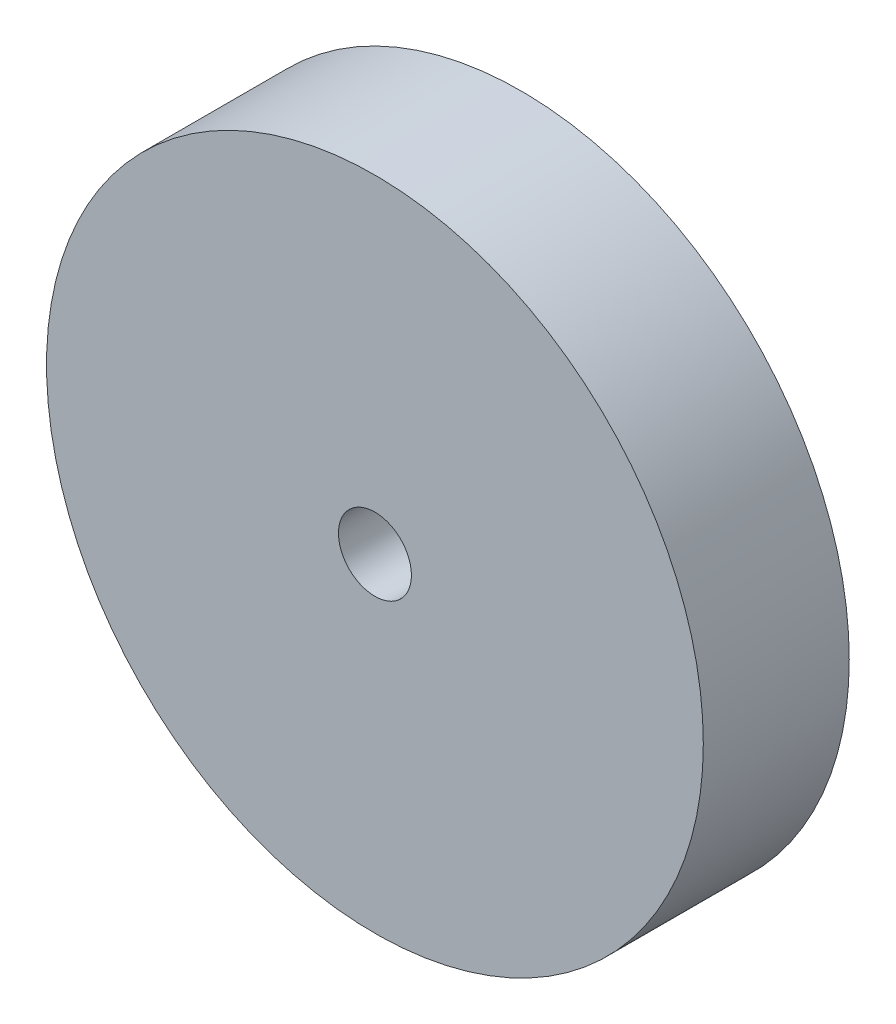
ISO-10303-21;
HEADER;
FILE_DESCRIPTION(('STEP AP214'),'2;1');
FILE_NAME('part.step','',(''),(''),'','','');
FILE_SCHEMA(('AUTOMOTIVE_DESIGN { 1 0 10303 214 1 1 1 1 }'));
ENDSEC;
DATA;
#1=APPLICATION_CONTEXT('core data for automotive mechanical design processes');
#2=APPLICATION_PROTOCOL_DEFINITION('international standard','automotive_design',2000,#1);
#3=PRODUCT_CONTEXT('',#1,'mechanical');
#4=PRODUCT('Part','Part','',(#3));
#5=PRODUCT_RELATED_PRODUCT_CATEGORY('part','',(#4));
#6=PRODUCT_DEFINITION_FORMATION('','',#4);
#7=PRODUCT_DEFINITION_CONTEXT('part definition',#1,'design');
#8=PRODUCT_DEFINITION('design','',#6,#7);
#9=PRODUCT_DEFINITION_SHAPE('','',#8);
#10=(LENGTH_UNIT() NAMED_UNIT(*) SI_UNIT(.MILLI.,.METRE.));
#11=(NAMED_UNIT(*) PLANE_ANGLE_UNIT() SI_UNIT($,.RADIAN.));
#12=(NAMED_UNIT(*) SI_UNIT($,.STERADIAN.) SOLID_ANGLE_UNIT());
#13=UNCERTAINTY_MEASURE_WITH_UNIT(LENGTH_MEASURE(1.E-05),#10,'distance_accuracy_value','');
#14=(GEOMETRIC_REPRESENTATION_CONTEXT(3) GLOBAL_UNCERTAINTY_ASSIGNED_CONTEXT((#13)) GLOBAL_UNIT_ASSIGNED_CONTEXT((#10,
#11,#12)) REPRESENTATION_CONTEXT('',''));
#15=CARTESIAN_POINT('',(0.,0.,0.));
#16=DIRECTION('',(0.,0.,1.));
#17=DIRECTION('',(1.,0.,0.));
#18=AXIS2_PLACEMENT_3D('',#15,#16,#17);
#19=CARTESIAN_POINT('',(0.,0.,4.));
#20=DIRECTION('',(0.,0.,-1.));
#21=DIRECTION('',(-1.,0.,0.));
#22=AXIS2_PLACEMENT_3D('',#19,#20,#21);
#23=CYLINDRICAL_SURFACE('',#22,9.);
#24=CARTESIAN_POINT('',(0.,0.,4.));
#25=DIRECTION('',(0.,0.,1.));
#26=DIRECTION('',(1.,0.,0.));
#27=AXIS2_PLACEMENT_3D('',#24,#25,#26);
#28=CIRCLE('',#27,9.);
#29=CARTESIAN_POINT('',(9.,0.,4.));
#30=VERTEX_POINT('',#29);
#31=EDGE_CURVE('E10',#30,#30,#28,.T.);
#32=ORIENTED_EDGE('',*,*,#31,.F.);
#33=EDGE_LOOP('',(#32));
#34=FACE_BOUND('',#33,.T.);
#35=CARTESIAN_POINT('',(0.,0.,0.));
#36=DIRECTION('',(0.,0.,1.));
#37=DIRECTION('',(1.,0.,0.));
#38=AXIS2_PLACEMENT_3D('',#35,#36,#37);
#39=CIRCLE('',#38,9.);
#40=CARTESIAN_POINT('',(9.,0.,0.));
#41=VERTEX_POINT('',#40);
#42=EDGE_CURVE('E44',#41,#41,#39,.T.);
#43=ORIENTED_EDGE('',*,*,#42,.T.);
#44=EDGE_LOOP('',(#43));
#45=FACE_BOUND('',#44,.T.);
#46=ADVANCED_FACE('F41',(#34,#45),#23,.T.);
#47=CARTESIAN_POINT('',(0.,0.,4.));
#48=DIRECTION('',(0.,0.,1.));
#49=DIRECTION('',(1.,0.,0.));
#50=AXIS2_PLACEMENT_3D('',#47,#48,#49);
#51=PLANE('',#50);
#52=CARTESIAN_POINT('',(0.,0.,4.));
#53=DIRECTION('',(0.,0.,1.));
#54=DIRECTION('',(1.,0.,0.));
#55=AXIS2_PLACEMENT_3D('',#52,#53,#54);
#56=CIRCLE('',#55,1.);
#57=CARTESIAN_POINT('',(1.,0.,4.));
#58=VERTEX_POINT('',#57);
#59=EDGE_CURVE('E55',#58,#58,#56,.T.);
#60=ORIENTED_EDGE('',*,*,#59,.F.);
#61=EDGE_LOOP('',(#60));
#62=FACE_BOUND('',#61,.T.);
#63=ORIENTED_EDGE('',*,*,#31,.T.);
#64=EDGE_LOOP('',(#63));
#65=FACE_BOUND('',#64,.T.);
#66=ADVANCED_FACE('F72',(#62,#65),#51,.T.);
#67=CARTESIAN_POINT('',(0.,0.,0.));
#68=DIRECTION('',(0.,0.,1.));
#69=DIRECTION('',(1.,0.,0.));
#70=AXIS2_PLACEMENT_3D('',#67,#68,#69);
#71=PLANE('',#70);
#72=CARTESIAN_POINT('',(0.,0.,0.));
#73=DIRECTION('',(0.,0.,1.));
#74=DIRECTION('',(1.,0.,0.));
#75=AXIS2_PLACEMENT_3D('',#72,#73,#74);
#76=CIRCLE('',#75,1.);
#77=CARTESIAN_POINT('',(1.,0.,0.));
#78=VERTEX_POINT('',#77);
#79=EDGE_CURVE('E53',#78,#78,#76,.T.);
#80=ORIENTED_EDGE('',*,*,#79,.T.);
#81=EDGE_LOOP('',(#80));
#82=FACE_BOUND('',#81,.T.);
#83=ORIENTED_EDGE('',*,*,#42,.F.);
#84=EDGE_LOOP('',(#83));
#85=FACE_BOUND('',#84,.T.);
#86=ADVANCED_FACE('F63',(#82,#85),#71,.F.);
#87=CARTESIAN_POINT('',(0.,0.,0.));
#88=DIRECTION('',(0.,0.,1.));
#89=DIRECTION('',(1.,0.,0.));
#90=AXIS2_PLACEMENT_3D('',#87,#88,#89);
#91=CYLINDRICAL_SURFACE('',#90,1.);
#92=ORIENTED_EDGE('',*,*,#79,.F.);
#93=EDGE_LOOP('',(#92));
#94=FACE_BOUND('',#93,.T.);
#95=ORIENTED_EDGE('',*,*,#59,.T.);
#96=EDGE_LOOP('',(#95));
#97=FACE_BOUND('',#96,.T.);
#98=ADVANCED_FACE('F66',(#94,#97),#91,.F.);
#99=CLOSED_SHELL('',(#46,#66,#86,#98));
#100=MANIFOLD_SOLID_BREP('B2',#99);
#101=ADVANCED_BREP_SHAPE_REPRESENTATION('',(#18,#100),#14);
#102=SHAPE_DEFINITION_REPRESENTATION(#9,#101);
ENDSEC;
END-ISO-10303-21;
